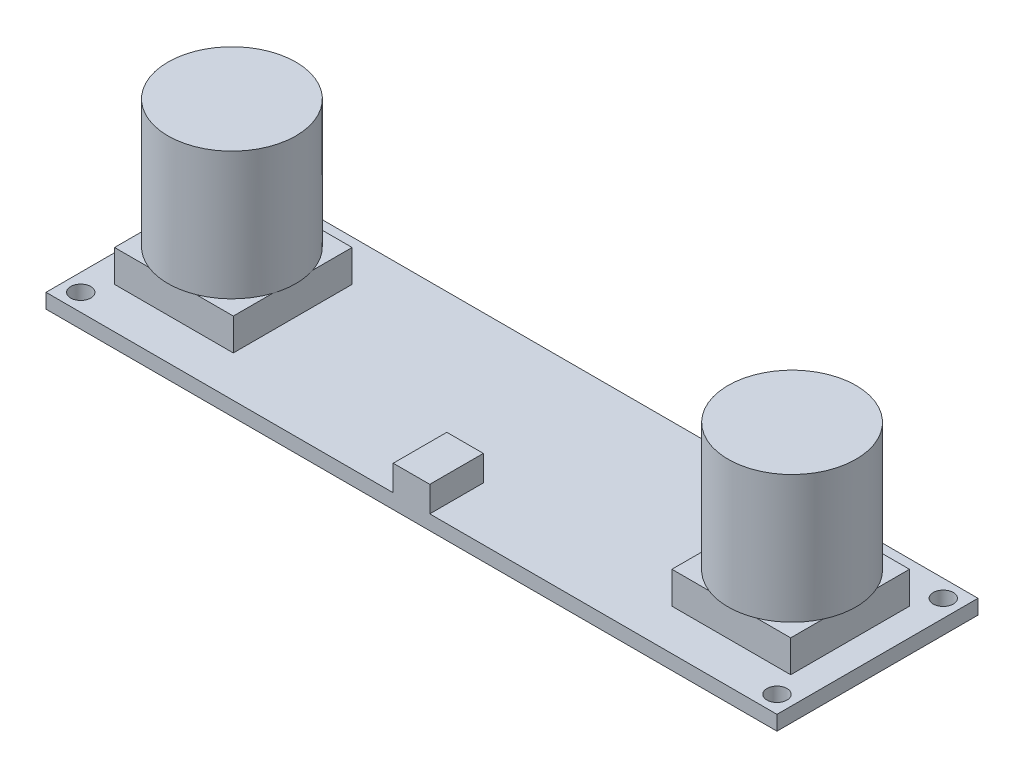
ISO-10303-21;
HEADER;
FILE_DESCRIPTION(('STEP AP214'),'2;1');
FILE_NAME('part.step','',(''),(''),'','','');
FILE_SCHEMA(('AUTOMOTIVE_DESIGN { 1 0 10303 214 1 1 1 1 }'));
ENDSEC;
DATA;
#1=APPLICATION_CONTEXT('core data for automotive mechanical design processes');
#2=APPLICATION_PROTOCOL_DEFINITION('international standard','automotive_design',2000,#1);
#3=PRODUCT_CONTEXT('',#1,'mechanical');
#4=PRODUCT('Part','Part','',(#3));
#5=PRODUCT_RELATED_PRODUCT_CATEGORY('part','',(#4));
#6=PRODUCT_DEFINITION_FORMATION('','',#4);
#7=PRODUCT_DEFINITION_CONTEXT('part definition',#1,'design');
#8=PRODUCT_DEFINITION('design','',#6,#7);
#9=PRODUCT_DEFINITION_SHAPE('','',#8);
#10=(LENGTH_UNIT() NAMED_UNIT(*) SI_UNIT(.MILLI.,.METRE.));
#11=(NAMED_UNIT(*) PLANE_ANGLE_UNIT() SI_UNIT($,.RADIAN.));
#12=(NAMED_UNIT(*) SI_UNIT($,.STERADIAN.) SOLID_ANGLE_UNIT());
#13=UNCERTAINTY_MEASURE_WITH_UNIT(LENGTH_MEASURE(1.E-05),#10,'distance_accuracy_value','');
#14=(GEOMETRIC_REPRESENTATION_CONTEXT(3) GLOBAL_UNCERTAINTY_ASSIGNED_CONTEXT((#13)) GLOBAL_UNIT_ASSIGNED_CONTEXT((#10,
#11,#12)) REPRESENTATION_CONTEXT('',''));
#15=CARTESIAN_POINT('',(0.,0.,0.));
#16=DIRECTION('',(0.,0.,1.));
#17=DIRECTION('',(1.,0.,0.));
#18=AXIS2_PLACEMENT_3D('',#15,#16,#17);
#19=CARTESIAN_POINT('',(0.,1.6,0.));
#20=DIRECTION('',(0.,1.,0.));
#21=DIRECTION('',(0.,0.,1.));
#22=AXIS2_PLACEMENT_3D('',#19,#20,#21);
#23=PLANE('',#22);
#24=CARTESIAN_POINT('',(38.1,1.6,-9.10000000000001));
#25=DIRECTION('',(0.,1.,0.));
#26=DIRECTION('',(0.,0.,-1.));
#27=AXIS2_PLACEMENT_3D('',#24,#25,#26);
#28=CIRCLE('',#27,1.1);
#29=CARTESIAN_POINT('',(38.1,1.6,-10.2));
#30=VERTEX_POINT('',#29);
#31=EDGE_CURVE('E238',#30,#30,#28,.T.);
#32=ORIENTED_EDGE('',*,*,#31,.F.);
#33=EDGE_LOOP('',(#32));
#34=FACE_BOUND('',#33,.T.);
#35=CARTESIAN_POINT('',(38.1,1.6,9.10000000000002));
#36=DIRECTION('',(0.,1.,0.));
#37=DIRECTION('',(0.,0.,1.));
#38=AXIS2_PLACEMENT_3D('',#35,#36,#37);
#39=CIRCLE('',#38,1.1);
#40=CARTESIAN_POINT('',(38.1,1.6,10.2));
#41=VERTEX_POINT('',#40);
#42=EDGE_CURVE('E253',#41,#41,#39,.T.);
#43=ORIENTED_EDGE('',*,*,#42,.F.);
#44=EDGE_LOOP('',(#43));
#45=FACE_BOUND('',#44,.T.);
#46=CARTESIAN_POINT('',(-38.1,1.6,9.10000000000002));
#47=DIRECTION('',(0.,1.,0.));
#48=DIRECTION('',(0.,0.,-1.));
#49=AXIS2_PLACEMENT_3D('',#46,#47,#48);
#50=CIRCLE('',#49,1.1);
#51=CARTESIAN_POINT('',(-38.1,1.6,8.00000000000002));
#52=VERTEX_POINT('',#51);
#53=EDGE_CURVE('E244',#52,#52,#50,.T.);
#54=ORIENTED_EDGE('',*,*,#53,.F.);
#55=EDGE_LOOP('',(#54));
#56=FACE_BOUND('',#55,.T.);
#57=CARTESIAN_POINT('',(-38.1,1.6,-9.10000000000001));
#58=DIRECTION('',(0.,1.,0.));
#59=DIRECTION('',(0.,0.,1.));
#60=AXIS2_PLACEMENT_3D('',#57,#58,#59);
#61=CIRCLE('',#60,1.1);
#62=CARTESIAN_POINT('',(-38.1,1.6,-8.00000000000001));
#63=VERTEX_POINT('',#62);
#64=EDGE_CURVE('E248',#63,#63,#61,.T.);
#65=ORIENTED_EDGE('',*,*,#64,.F.);
#66=EDGE_LOOP('',(#65));
#67=FACE_BOUND('',#66,.T.);
#68=DIRECTION('',(1.,0.,0.));
#69=VECTOR('',#68,1.);
#70=CARTESIAN_POINT('',(-24.,1.6,6.5));
#71=LINE('',#70,#69);
#72=CARTESIAN_POINT('',(-37.,1.6,6.5));
#73=VERTEX_POINT('',#72);
#74=CARTESIAN_POINT('',(-24.,1.6,6.5));
#75=VERTEX_POINT('',#74);
#76=EDGE_CURVE('E370',#73,#75,#71,.T.);
#77=ORIENTED_EDGE('',*,*,#76,.F.);
#78=DIRECTION('',(0.,0.,1.));
#79=VECTOR('',#78,1.);
#80=CARTESIAN_POINT('',(-37.,1.6,6.5));
#81=LINE('',#80,#79);
#82=CARTESIAN_POINT('',(-37.,1.6,-6.5));
#83=VERTEX_POINT('',#82);
#84=EDGE_CURVE('E321',#83,#73,#81,.T.);
#85=ORIENTED_EDGE('',*,*,#84,.F.);
#86=DIRECTION('',(-1.,0.,0.));
#87=VECTOR('',#86,1.);
#88=CARTESIAN_POINT('',(-24.,1.6,-6.5));
#89=LINE('',#88,#87);
#90=CARTESIAN_POINT('',(-24.,1.6,-6.5));
#91=VERTEX_POINT('',#90);
#92=EDGE_CURVE('E377',#91,#83,#89,.T.);
#93=ORIENTED_EDGE('',*,*,#92,.F.);
#94=DIRECTION('',(0.,0.,-1.));
#95=VECTOR('',#94,1.);
#96=CARTESIAN_POINT('',(-24.,1.6,6.5));
#97=LINE('',#96,#95);
#98=EDGE_CURVE('E373',#75,#91,#97,.T.);
#99=ORIENTED_EDGE('',*,*,#98,.F.);
#100=EDGE_LOOP('',(#77,#85,#93,#99));
#101=FACE_BOUND('',#100,.T.);
#102=DIRECTION('',(0.,0.,-1.));
#103=VECTOR('',#102,1.);
#104=CARTESIAN_POINT('',(37.,1.6,6.49999999999999));
#105=LINE('',#104,#103);
#106=CARTESIAN_POINT('',(37.,1.6,6.49999999999999));
#107=VERTEX_POINT('',#106);
#108=CARTESIAN_POINT('',(37.,1.6,-6.50000000000001));
#109=VERTEX_POINT('',#108);
#110=EDGE_CURVE('E314',#107,#109,#105,.T.);
#111=ORIENTED_EDGE('',*,*,#110,.F.);
#112=DIRECTION('',(1.,0.,0.));
#113=VECTOR('',#112,1.);
#114=CARTESIAN_POINT('',(24.,1.6,6.49999999999999));
#115=LINE('',#114,#113);
#116=CARTESIAN_POINT('',(24.,1.6,6.49999999999999));
#117=VERTEX_POINT('',#116);
#118=EDGE_CURVE('E317',#117,#107,#115,.T.);
#119=ORIENTED_EDGE('',*,*,#118,.F.);
#120=DIRECTION('',(0.,0.,1.));
#121=VECTOR('',#120,1.);
#122=CARTESIAN_POINT('',(24.,1.6,6.49999999999999));
#123=LINE('',#122,#121);
#124=CARTESIAN_POINT('',(24.,1.6,-6.50000000000001));
#125=VERTEX_POINT('',#124);
#126=EDGE_CURVE('E306',#125,#117,#123,.T.);
#127=ORIENTED_EDGE('',*,*,#126,.F.);
#128=DIRECTION('',(-1.,0.,0.));
#129=VECTOR('',#128,1.);
#130=CARTESIAN_POINT('',(24.,1.6,-6.50000000000001));
#131=LINE('',#130,#129);
#132=EDGE_CURVE('E309',#109,#125,#131,.T.);
#133=ORIENTED_EDGE('',*,*,#132,.F.);
#134=EDGE_LOOP('',(#111,#119,#127,#133));
#135=FACE_BOUND('',#134,.T.);
#136=DIRECTION('',(-1.,0.,0.));
#137=VECTOR('',#136,1.);
#138=CARTESIAN_POINT('',(-1.99999999999999,1.6,5.13629272388911));
#139=LINE('',#138,#137);
#140=CARTESIAN_POINT('',(2.00000000000002,1.6,5.13629272388911));
#141=VERTEX_POINT('',#140);
#142=CARTESIAN_POINT('',(-1.99999999999999,1.6,5.13629272388911));
#143=VERTEX_POINT('',#142);
#144=EDGE_CURVE('E62',#141,#143,#139,.T.);
#145=ORIENTED_EDGE('',*,*,#144,.F.);
#146=DIRECTION('',(0.,0.,-1.));
#147=VECTOR('',#146,1.);
#148=CARTESIAN_POINT('',(2.00000000000002,1.6,5.13629272388911));
#149=LINE('',#148,#147);
#150=CARTESIAN_POINT('',(2.00000000000002,1.6,11.));
#151=VERTEX_POINT('',#150);
#152=EDGE_CURVE('E963',#151,#141,#149,.T.);
#153=ORIENTED_EDGE('',*,*,#152,.F.);
#154=DIRECTION('',(1.,0.,0.));
#155=VECTOR('',#154,1.);
#156=CARTESIAN_POINT('',(40.,1.6,11.));
#157=LINE('',#156,#155);
#158=CARTESIAN_POINT('',(40.,1.6,11.));
#159=VERTEX_POINT('',#158);
#160=EDGE_CURVE('E231',#151,#159,#157,.T.);
#161=ORIENTED_EDGE('',*,*,#160,.T.);
#162=DIRECTION('',(0.,0.,-1.));
#163=VECTOR('',#162,1.);
#164=CARTESIAN_POINT('',(40.,1.6,11.));
#165=LINE('',#164,#163);
#166=CARTESIAN_POINT('',(40.,1.6,-11.));
#167=VERTEX_POINT('',#166);
#168=EDGE_CURVE('E402',#159,#167,#165,.T.);
#169=ORIENTED_EDGE('',*,*,#168,.T.);
#170=DIRECTION('',(-1.,0.,0.));
#171=VECTOR('',#170,1.);
#172=CARTESIAN_POINT('',(40.,1.6,-11.));
#173=LINE('',#172,#171);
#174=CARTESIAN_POINT('',(-40.,1.6,-11.));
#175=VERTEX_POINT('',#174);
#176=EDGE_CURVE('E405',#167,#175,#173,.T.);
#177=ORIENTED_EDGE('',*,*,#176,.T.);
#178=DIRECTION('',(0.,0.,1.));
#179=VECTOR('',#178,1.);
#180=CARTESIAN_POINT('',(-40.,1.6,11.));
#181=LINE('',#180,#179);
#182=CARTESIAN_POINT('',(-40.,1.6,11.));
#183=VERTEX_POINT('',#182);
#184=EDGE_CURVE('E394',#175,#183,#181,.T.);
#185=ORIENTED_EDGE('',*,*,#184,.T.);
#186=CARTESIAN_POINT('',(-1.99999999999999,1.6,11.));
#187=VERTEX_POINT('',#186);
#188=EDGE_CURVE('E399',#183,#187,#157,.T.);
#189=ORIENTED_EDGE('',*,*,#188,.T.);
#190=DIRECTION('',(0.,0.,1.));
#191=VECTOR('',#190,1.);
#192=CARTESIAN_POINT('',(-1.99999999999999,1.6,11.));
#193=LINE('',#192,#191);
#194=EDGE_CURVE('E67',#143,#187,#193,.T.);
#195=ORIENTED_EDGE('',*,*,#194,.F.);
#196=EDGE_LOOP('',(#145,#153,#161,#169,#177,#185,#189,#195));
#197=FACE_BOUND('',#196,.T.);
#198=ADVANCED_FACE('F43',(#34,#45,#56,#67,#101,#135,#197),#23,.T.);
#199=CARTESIAN_POINT('',(0.,5.1,0.));
#200=DIRECTION('',(0.,1.,0.));
#201=DIRECTION('',(0.,0.,1.));
#202=AXIS2_PLACEMENT_3D('',#199,#200,#201);
#203=PLANE('',#202);
#204=CARTESIAN_POINT('',(30.65,5.1,0.));
#205=DIRECTION('',(0.,1.,0.));
#206=DIRECTION('',(0.,0.,-1.));
#207=AXIS2_PLACEMENT_3D('',#204,#205,#206);
#208=CIRCLE('',#207,7.);
#209=CARTESIAN_POINT('',(28.0519237886467,5.1,-6.50000000000001));
#210=VERTEX_POINT('',#209);
#211=CARTESIAN_POINT('',(24.,5.1,-2.18574929943935));
#212=VERTEX_POINT('',#211);
#213=EDGE_CURVE('E271',#210,#212,#208,.T.);
#214=ORIENTED_EDGE('',*,*,#213,.F.);
#215=DIRECTION('',(-1.,0.,0.));
#216=VECTOR('',#215,1.);
#217=CARTESIAN_POINT('',(24.,5.1,-6.50000000000001));
#218=LINE('',#217,#216);
#219=CARTESIAN_POINT('',(24.,5.1,-6.50000000000001));
#220=VERTEX_POINT('',#219);
#221=EDGE_CURVE('E326',#210,#220,#218,.T.);
#222=ORIENTED_EDGE('',*,*,#221,.T.);
#223=DIRECTION('',(0.,0.,1.));
#224=VECTOR('',#223,1.);
#225=CARTESIAN_POINT('',(24.,5.1,6.49999999999999));
#226=LINE('',#225,#224);
#227=EDGE_CURVE('E322',#220,#212,#226,.T.);
#228=ORIENTED_EDGE('',*,*,#227,.T.);
#229=EDGE_LOOP('',(#214,#222,#228));
#230=FACE_BOUND('',#229,.T.);
#231=ADVANCED_FACE('F514',(#230),#203,.T.);
#232=CARTESIAN_POINT('',(24.,5.1,2.18574929943935));
#233=VERTEX_POINT('',#232);
#234=CARTESIAN_POINT('',(28.0519237886467,5.1,6.49999999999999));
#235=VERTEX_POINT('',#234);
#236=EDGE_CURVE('E11',#233,#235,#208,.T.);
#237=ORIENTED_EDGE('',*,*,#236,.F.);
#238=CARTESIAN_POINT('',(24.,5.1,6.49999999999999));
#239=VERTEX_POINT('',#238);
#240=EDGE_CURVE('E305',#233,#239,#226,.T.);
#241=ORIENTED_EDGE('',*,*,#240,.T.);
#242=DIRECTION('',(1.,0.,0.));
#243=VECTOR('',#242,1.);
#244=CARTESIAN_POINT('',(24.,5.1,6.49999999999999));
#245=LINE('',#244,#243);
#246=EDGE_CURVE('E310',#239,#235,#245,.T.);
#247=ORIENTED_EDGE('',*,*,#246,.T.);
#248=EDGE_LOOP('',(#237,#241,#247));
#249=FACE_BOUND('',#248,.T.);
#250=ADVANCED_FACE('F571',(#249),#203,.T.);
#251=CARTESIAN_POINT('',(33.2480762113534,5.1,6.49999999999999));
#252=VERTEX_POINT('',#251);
#253=CARTESIAN_POINT('',(37.,5.1,2.94575966433116));
#254=VERTEX_POINT('',#253);
#255=EDGE_CURVE('E53',#252,#254,#208,.T.);
#256=ORIENTED_EDGE('',*,*,#255,.F.);
#257=CARTESIAN_POINT('',(37.,5.1,6.49999999999999));
#258=VERTEX_POINT('',#257);
#259=EDGE_CURVE('E337',#252,#258,#245,.T.);
#260=ORIENTED_EDGE('',*,*,#259,.T.);
#261=DIRECTION('',(0.,0.,-1.));
#262=VECTOR('',#261,1.);
#263=CARTESIAN_POINT('',(37.,5.1,6.49999999999999));
#264=LINE('',#263,#262);
#265=EDGE_CURVE('E333',#258,#254,#264,.T.);
#266=ORIENTED_EDGE('',*,*,#265,.T.);
#267=EDGE_LOOP('',(#256,#260,#266));
#268=FACE_BOUND('',#267,.T.);
#269=ADVANCED_FACE('F582',(#268),#203,.T.);
#270=CARTESIAN_POINT('',(0.,5.1,0.));
#271=DIRECTION('',(0.,1.,0.));
#272=DIRECTION('',(0.,0.,1.));
#273=AXIS2_PLACEMENT_3D('',#270,#271,#272);
#274=PLANE('',#273);
#275=CARTESIAN_POINT('',(-30.65,5.1,0.));
#276=DIRECTION('',(0.,1.,0.));
#277=DIRECTION('',(0.,0.,1.));
#278=AXIS2_PLACEMENT_3D('',#275,#276,#277);
#279=CIRCLE('',#278,7.);
#280=CARTESIAN_POINT('',(-28.0519237886467,5.1,6.5));
#281=VERTEX_POINT('',#280);
#282=CARTESIAN_POINT('',(-24.,5.1,2.18574929943942));
#283=VERTEX_POINT('',#282);
#284=EDGE_CURVE('E286',#281,#283,#279,.T.);
#285=ORIENTED_EDGE('',*,*,#284,.F.);
#286=DIRECTION('',(1.,0.,0.));
#287=VECTOR('',#286,1.);
#288=CARTESIAN_POINT('',(-24.,5.1,6.5));
#289=LINE('',#288,#287);
#290=CARTESIAN_POINT('',(-24.,5.1,6.5));
#291=VERTEX_POINT('',#290);
#292=EDGE_CURVE('E347',#281,#291,#289,.T.);
#293=ORIENTED_EDGE('',*,*,#292,.T.);
#294=DIRECTION('',(0.,0.,-1.));
#295=VECTOR('',#294,1.);
#296=CARTESIAN_POINT('',(-24.,5.1,6.5));
#297=LINE('',#296,#295);
#298=EDGE_CURVE('E355',#291,#283,#297,.T.);
#299=ORIENTED_EDGE('',*,*,#298,.T.);
#300=EDGE_LOOP('',(#285,#293,#299));
#301=FACE_BOUND('',#300,.T.);
#302=ADVANCED_FACE('F472',(#301),#274,.T.);
#303=CARTESIAN_POINT('',(-24.,5.1,-2.18574929943943));
#304=VERTEX_POINT('',#303);
#305=CARTESIAN_POINT('',(-28.0519237886467,5.1,-6.5));
#306=VERTEX_POINT('',#305);
#307=EDGE_CURVE('E443',#304,#306,#279,.T.);
#308=ORIENTED_EDGE('',*,*,#307,.F.);
#309=CARTESIAN_POINT('',(-24.,5.1,-6.5));
#310=VERTEX_POINT('',#309);
#311=EDGE_CURVE('E353',#304,#310,#297,.T.);
#312=ORIENTED_EDGE('',*,*,#311,.T.);
#313=DIRECTION('',(-1.,0.,0.));
#314=VECTOR('',#313,1.);
#315=CARTESIAN_POINT('',(-24.,5.1,-6.5));
#316=LINE('',#315,#314);
#317=EDGE_CURVE('E361',#310,#306,#316,.T.);
#318=ORIENTED_EDGE('',*,*,#317,.T.);
#319=EDGE_LOOP('',(#308,#312,#318));
#320=FACE_BOUND('',#319,.T.);
#321=ADVANCED_FACE('F486',(#320),#274,.T.);
#322=CARTESIAN_POINT('',(-33.2480762113533,5.1,-6.5));
#323=VERTEX_POINT('',#322);
#324=CARTESIAN_POINT('',(-37.,5.1,-2.9457596643311));
#325=VERTEX_POINT('',#324);
#326=EDGE_CURVE('E437',#323,#325,#279,.T.);
#327=ORIENTED_EDGE('',*,*,#326,.F.);
#328=CARTESIAN_POINT('',(-37.,5.1,-6.5));
#329=VERTEX_POINT('',#328);
#330=EDGE_CURVE('E359',#323,#329,#316,.T.);
#331=ORIENTED_EDGE('',*,*,#330,.T.);
#332=DIRECTION('',(0.,0.,1.));
#333=VECTOR('',#332,1.);
#334=CARTESIAN_POINT('',(-37.,5.1,6.5));
#335=LINE('',#334,#333);
#336=EDGE_CURVE('E343',#329,#325,#335,.T.);
#337=ORIENTED_EDGE('',*,*,#336,.T.);
#338=EDGE_LOOP('',(#327,#331,#337));
#339=FACE_BOUND('',#338,.T.);
#340=ADVANCED_FACE('F498',(#339),#274,.T.);
#341=CARTESIAN_POINT('',(-40.,1.6,11.));
#342=DIRECTION('',(1.,0.,0.));
#343=DIRECTION('',(0.,0.,-1.));
#344=AXIS2_PLACEMENT_3D('',#341,#342,#343);
#345=PLANE('',#344);
#346=DIRECTION('',(0.,0.,1.));
#347=VECTOR('',#346,1.);
#348=CARTESIAN_POINT('',(-40.,0.,11.));
#349=LINE('',#348,#347);
#350=CARTESIAN_POINT('',(-40.,0.,-11.));
#351=VERTEX_POINT('',#350);
#352=CARTESIAN_POINT('',(-40.,0.,11.));
#353=VERTEX_POINT('',#352);
#354=EDGE_CURVE('E393',#351,#353,#349,.T.);
#355=ORIENTED_EDGE('',*,*,#354,.T.);
#356=DIRECTION('',(0.,-1.,0.));
#357=VECTOR('',#356,1.);
#358=CARTESIAN_POINT('',(-40.,1.6,11.));
#359=LINE('',#358,#357);
#360=EDGE_CURVE('E47',#183,#353,#359,.T.);
#361=ORIENTED_EDGE('',*,*,#360,.F.);
#362=ORIENTED_EDGE('',*,*,#184,.F.);
#363=DIRECTION('',(0.,-1.,0.));
#364=VECTOR('',#363,1.);
#365=CARTESIAN_POINT('',(-40.,1.6,-11.));
#366=LINE('',#365,#364);
#367=EDGE_CURVE('E408',#175,#351,#366,.T.);
#368=ORIENTED_EDGE('',*,*,#367,.T.);
#369=EDGE_LOOP('',(#355,#361,#362,#368));
#370=FACE_BOUND('',#369,.T.);
#371=ADVANCED_FACE('F45',(#370),#345,.F.);
#372=CARTESIAN_POINT('',(40.,1.6,11.));
#373=DIRECTION('',(0.,0.,-1.));
#374=DIRECTION('',(-1.,0.,0.));
#375=AXIS2_PLACEMENT_3D('',#372,#373,#374);
#376=PLANE('',#375);
#377=DIRECTION('',(1.,0.,0.));
#378=VECTOR('',#377,1.);
#379=CARTESIAN_POINT('',(40.,0.,11.));
#380=LINE('',#379,#378);
#381=CARTESIAN_POINT('',(40.,0.,11.));
#382=VERTEX_POINT('',#381);
#383=EDGE_CURVE('E412',#353,#382,#380,.T.);
#384=ORIENTED_EDGE('',*,*,#383,.T.);
#385=DIRECTION('',(0.,-1.,0.));
#386=VECTOR('',#385,1.);
#387=CARTESIAN_POINT('',(40.,1.6,11.));
#388=LINE('',#387,#386);
#389=EDGE_CURVE('E426',#159,#382,#388,.T.);
#390=ORIENTED_EDGE('',*,*,#389,.F.);
#391=ORIENTED_EDGE('',*,*,#160,.F.);
#392=DIRECTION('',(0.,-1.,0.));
#393=VECTOR('',#392,1.);
#394=CARTESIAN_POINT('',(2.00000000000002,4.4,11.));
#395=LINE('',#394,#393);
#396=CARTESIAN_POINT('',(2.00000000000002,4.4,11.));
#397=VERTEX_POINT('',#396);
#398=EDGE_CURVE('E211',#397,#151,#395,.T.);
#399=ORIENTED_EDGE('',*,*,#398,.F.);
#400=DIRECTION('',(1.,0.,0.));
#401=VECTOR('',#400,1.);
#402=CARTESIAN_POINT('',(0.,4.4,11.));
#403=LINE('',#402,#401);
#404=CARTESIAN_POINT('',(-1.99999999999999,4.4,11.));
#405=VERTEX_POINT('',#404);
#406=EDGE_CURVE('E218',#405,#397,#403,.T.);
#407=ORIENTED_EDGE('',*,*,#406,.F.);
#408=DIRECTION('',(0.,-1.,0.));
#409=VECTOR('',#408,1.);
#410=CARTESIAN_POINT('',(-1.99999999999999,4.4,11.));
#411=LINE('',#410,#409);
#412=EDGE_CURVE('E951',#405,#187,#411,.T.);
#413=ORIENTED_EDGE('',*,*,#412,.T.);
#414=ORIENTED_EDGE('',*,*,#188,.F.);
#415=ORIENTED_EDGE('',*,*,#360,.T.);
#416=EDGE_LOOP('',(#384,#390,#391,#399,#407,#413,#414,#415));
#417=FACE_BOUND('',#416,.T.);
#418=ADVANCED_FACE('F229',(#417),#376,.F.);
#419=CARTESIAN_POINT('',(40.,1.6,11.));
#420=DIRECTION('',(-1.,0.,0.));
#421=DIRECTION('',(0.,0.,1.));
#422=AXIS2_PLACEMENT_3D('',#419,#420,#421);
#423=PLANE('',#422);
#424=DIRECTION('',(0.,0.,-1.));
#425=VECTOR('',#424,1.);
#426=CARTESIAN_POINT('',(40.,0.,11.));
#427=LINE('',#426,#425);
#428=CARTESIAN_POINT('',(40.,0.,-11.));
#429=VERTEX_POINT('',#428);
#430=EDGE_CURVE('E415',#382,#429,#427,.T.);
#431=ORIENTED_EDGE('',*,*,#430,.T.);
#432=DIRECTION('',(0.,-1.,0.));
#433=VECTOR('',#432,1.);
#434=CARTESIAN_POINT('',(40.,1.6,-11.));
#435=LINE('',#434,#433);
#436=EDGE_CURVE('E423',#167,#429,#435,.T.);
#437=ORIENTED_EDGE('',*,*,#436,.F.);
#438=ORIENTED_EDGE('',*,*,#168,.F.);
#439=ORIENTED_EDGE('',*,*,#389,.T.);
#440=EDGE_LOOP('',(#431,#437,#438,#439));
#441=FACE_BOUND('',#440,.T.);
#442=ADVANCED_FACE('F903',(#441),#423,.F.);
#443=CARTESIAN_POINT('',(40.,1.6,-11.));
#444=DIRECTION('',(0.,0.,1.));
#445=DIRECTION('',(1.,0.,0.));
#446=AXIS2_PLACEMENT_3D('',#443,#444,#445);
#447=PLANE('',#446);
#448=DIRECTION('',(-1.,0.,0.));
#449=VECTOR('',#448,1.);
#450=CARTESIAN_POINT('',(40.,0.,-11.));
#451=LINE('',#450,#449);
#452=EDGE_CURVE('E398',#429,#351,#451,.T.);
#453=ORIENTED_EDGE('',*,*,#452,.T.);
#454=ORIENTED_EDGE('',*,*,#367,.F.);
#455=ORIENTED_EDGE('',*,*,#176,.F.);
#456=ORIENTED_EDGE('',*,*,#436,.T.);
#457=EDGE_LOOP('',(#453,#454,#455,#456));
#458=FACE_BOUND('',#457,.T.);
#459=ADVANCED_FACE('F843',(#458),#447,.F.);
#460=CARTESIAN_POINT('',(0.,0.,0.));
#461=DIRECTION('',(0.,1.,0.));
#462=DIRECTION('',(0.,0.,1.));
#463=AXIS2_PLACEMENT_3D('',#460,#461,#462);
#464=PLANE('',#463);
#465=CARTESIAN_POINT('',(38.1,0.,-9.10000000000001));
#466=DIRECTION('',(0.,1.,0.));
#467=DIRECTION('',(0.,0.,-1.));
#468=AXIS2_PLACEMENT_3D('',#465,#466,#467);
#469=CIRCLE('',#468,1.1);
#470=CARTESIAN_POINT('',(38.1,0.,-10.2));
#471=VERTEX_POINT('',#470);
#472=EDGE_CURVE('E233',#471,#471,#469,.T.);
#473=ORIENTED_EDGE('',*,*,#472,.T.);
#474=EDGE_LOOP('',(#473));
#475=FACE_BOUND('',#474,.T.);
#476=CARTESIAN_POINT('',(38.1,0.,9.10000000000002));
#477=DIRECTION('',(0.,1.,0.));
#478=DIRECTION('',(0.,0.,1.));
#479=AXIS2_PLACEMENT_3D('',#476,#477,#478);
#480=CIRCLE('',#479,1.1);
#481=CARTESIAN_POINT('',(38.1,0.,10.2));
#482=VERTEX_POINT('',#481);
#483=EDGE_CURVE('E257',#482,#482,#480,.T.);
#484=ORIENTED_EDGE('',*,*,#483,.T.);
#485=EDGE_LOOP('',(#484));
#486=FACE_BOUND('',#485,.T.);
#487=CARTESIAN_POINT('',(-38.1,0.,9.10000000000002));
#488=DIRECTION('',(0.,1.,0.));
#489=DIRECTION('',(0.,0.,-1.));
#490=AXIS2_PLACEMENT_3D('',#487,#488,#489);
#491=CIRCLE('',#490,1.1);
#492=CARTESIAN_POINT('',(-38.1,0.,8.00000000000002));
#493=VERTEX_POINT('',#492);
#494=EDGE_CURVE('E249',#493,#493,#491,.T.);
#495=ORIENTED_EDGE('',*,*,#494,.T.);
#496=EDGE_LOOP('',(#495));
#497=FACE_BOUND('',#496,.T.);
#498=CARTESIAN_POINT('',(-38.1,0.,-9.10000000000001));
#499=DIRECTION('',(0.,1.,0.));
#500=DIRECTION('',(0.,0.,1.));
#501=AXIS2_PLACEMENT_3D('',#498,#499,#500);
#502=CIRCLE('',#501,1.1);
#503=CARTESIAN_POINT('',(-38.1,0.,-8.00000000000001));
#504=VERTEX_POINT('',#503);
#505=EDGE_CURVE('E264',#504,#504,#502,.T.);
#506=ORIENTED_EDGE('',*,*,#505,.T.);
#507=EDGE_LOOP('',(#506));
#508=FACE_BOUND('',#507,.T.);
#509=ORIENTED_EDGE('',*,*,#354,.F.);
#510=ORIENTED_EDGE('',*,*,#452,.F.);
#511=ORIENTED_EDGE('',*,*,#430,.F.);
#512=ORIENTED_EDGE('',*,*,#383,.F.);
#513=EDGE_LOOP('',(#509,#510,#511,#512));
#514=FACE_BOUND('',#513,.T.);
#515=ADVANCED_FACE('F648',(#475,#486,#497,#508,#514),#464,.F.);
#516=CARTESIAN_POINT('',(-37.,5.1,6.5));
#517=DIRECTION('',(1.,0.,0.));
#518=DIRECTION('',(0.,0.,-1.));
#519=AXIS2_PLACEMENT_3D('',#516,#517,#518);
#520=PLANE('',#519);
#521=ORIENTED_EDGE('',*,*,#84,.T.);
#522=DIRECTION('',(0.,-1.,0.));
#523=VECTOR('',#522,1.);
#524=CARTESIAN_POINT('',(-37.,5.1,6.5));
#525=LINE('',#524,#523);
#526=CARTESIAN_POINT('',(-37.,5.1,6.5));
#527=VERTEX_POINT('',#526);
#528=EDGE_CURVE('E390',#527,#73,#525,.T.);
#529=ORIENTED_EDGE('',*,*,#528,.F.);
#530=CARTESIAN_POINT('',(-37.,5.1,2.9457596643311));
#531=VERTEX_POINT('',#530);
#532=EDGE_CURVE('E349',#531,#527,#335,.T.);
#533=ORIENTED_EDGE('',*,*,#532,.F.);
#534=EDGE_CURVE('E348',#325,#531,#335,.T.);
#535=ORIENTED_EDGE('',*,*,#534,.F.);
#536=ORIENTED_EDGE('',*,*,#336,.F.);
#537=DIRECTION('',(0.,-1.,0.));
#538=VECTOR('',#537,1.);
#539=CARTESIAN_POINT('',(-37.,5.1,-6.5));
#540=LINE('',#539,#538);
#541=EDGE_CURVE('E365',#329,#83,#540,.T.);
#542=ORIENTED_EDGE('',*,*,#541,.T.);
#543=EDGE_LOOP('',(#521,#529,#533,#535,#536,#542));
#544=FACE_BOUND('',#543,.T.);
#545=ADVANCED_FACE('F502',(#544),#520,.F.);
#546=CARTESIAN_POINT('',(-24.,5.1,6.5));
#547=DIRECTION('',(0.,0.,-1.));
#548=DIRECTION('',(-1.,0.,0.));
#549=AXIS2_PLACEMENT_3D('',#546,#547,#548);
#550=PLANE('',#549);
#551=ORIENTED_EDGE('',*,*,#76,.T.);
#552=DIRECTION('',(0.,-1.,0.));
#553=VECTOR('',#552,1.);
#554=CARTESIAN_POINT('',(-24.,5.1,6.5));
#555=LINE('',#554,#553);
#556=EDGE_CURVE('E386',#291,#75,#555,.T.);
#557=ORIENTED_EDGE('',*,*,#556,.F.);
#558=ORIENTED_EDGE('',*,*,#292,.F.);
#559=CARTESIAN_POINT('',(-33.2480762113533,5.1,6.5));
#560=VERTEX_POINT('',#559);
#561=EDGE_CURVE('E354',#560,#281,#289,.T.);
#562=ORIENTED_EDGE('',*,*,#561,.F.);
#563=EDGE_CURVE('E350',#527,#560,#289,.T.);
#564=ORIENTED_EDGE('',*,*,#563,.F.);
#565=ORIENTED_EDGE('',*,*,#528,.T.);
#566=EDGE_LOOP('',(#551,#557,#558,#562,#564,#565));
#567=FACE_BOUND('',#566,.T.);
#568=ADVANCED_FACE('F474',(#567),#550,.F.);
#569=CARTESIAN_POINT('',(-24.,5.1,6.5));
#570=DIRECTION('',(-1.,0.,0.));
#571=DIRECTION('',(0.,0.,1.));
#572=AXIS2_PLACEMENT_3D('',#569,#570,#571);
#573=PLANE('',#572);
#574=ORIENTED_EDGE('',*,*,#98,.T.);
#575=DIRECTION('',(0.,-1.,0.));
#576=VECTOR('',#575,1.);
#577=CARTESIAN_POINT('',(-24.,5.1,-6.5));
#578=LINE('',#577,#576);
#579=EDGE_CURVE('E383',#310,#91,#578,.T.);
#580=ORIENTED_EDGE('',*,*,#579,.F.);
#581=ORIENTED_EDGE('',*,*,#311,.F.);
#582=EDGE_CURVE('E360',#283,#304,#297,.T.);
#583=ORIENTED_EDGE('',*,*,#582,.F.);
#584=ORIENTED_EDGE('',*,*,#298,.F.);
#585=ORIENTED_EDGE('',*,*,#556,.T.);
#586=EDGE_LOOP('',(#574,#580,#581,#583,#584,#585));
#587=FACE_BOUND('',#586,.T.);
#588=ADVANCED_FACE('F478',(#587),#573,.F.);
#589=CARTESIAN_POINT('',(-24.,5.1,-6.5));
#590=DIRECTION('',(0.,0.,1.));
#591=DIRECTION('',(1.,0.,0.));
#592=AXIS2_PLACEMENT_3D('',#589,#590,#591);
#593=PLANE('',#592);
#594=ORIENTED_EDGE('',*,*,#92,.T.);
#595=ORIENTED_EDGE('',*,*,#541,.F.);
#596=ORIENTED_EDGE('',*,*,#330,.F.);
#597=EDGE_CURVE('E366',#306,#323,#316,.T.);
#598=ORIENTED_EDGE('',*,*,#597,.F.);
#599=ORIENTED_EDGE('',*,*,#317,.F.);
#600=ORIENTED_EDGE('',*,*,#579,.T.);
#601=EDGE_LOOP('',(#594,#595,#596,#598,#599,#600));
#602=FACE_BOUND('',#601,.T.);
#603=ADVANCED_FACE('F490',(#602),#593,.F.);
#604=EDGE_CURVE('E291',#531,#560,#279,.T.);
#605=ORIENTED_EDGE('',*,*,#604,.F.);
#606=ORIENTED_EDGE('',*,*,#532,.T.);
#607=ORIENTED_EDGE('',*,*,#563,.T.);
#608=EDGE_LOOP('',(#605,#606,#607));
#609=FACE_BOUND('',#608,.T.);
#610=ADVANCED_FACE('F510',(#609),#274,.T.);
#611=CARTESIAN_POINT('',(24.,5.1,6.49999999999999));
#612=DIRECTION('',(0.,0.,-1.));
#613=DIRECTION('',(-1.,0.,0.));
#614=AXIS2_PLACEMENT_3D('',#611,#612,#613);
#615=PLANE('',#614);
#616=ORIENTED_EDGE('',*,*,#118,.T.);
#617=DIRECTION('',(0.,-1.,0.));
#618=VECTOR('',#617,1.);
#619=CARTESIAN_POINT('',(37.,5.1,6.49999999999999));
#620=LINE('',#619,#618);
#621=EDGE_CURVE('E285',#258,#107,#620,.T.);
#622=ORIENTED_EDGE('',*,*,#621,.F.);
#623=ORIENTED_EDGE('',*,*,#259,.F.);
#624=EDGE_CURVE('E342',#235,#252,#245,.T.);
#625=ORIENTED_EDGE('',*,*,#624,.F.);
#626=ORIENTED_EDGE('',*,*,#246,.F.);
#627=DIRECTION('',(0.,-1.,0.));
#628=VECTOR('',#627,1.);
#629=CARTESIAN_POINT('',(24.,5.1,6.49999999999999));
#630=LINE('',#629,#628);
#631=EDGE_CURVE('E301',#239,#117,#630,.T.);
#632=ORIENTED_EDGE('',*,*,#631,.T.);
#633=EDGE_LOOP('',(#616,#622,#623,#625,#626,#632));
#634=FACE_BOUND('',#633,.T.);
#635=ADVANCED_FACE('F575',(#634),#615,.F.);
#636=CARTESIAN_POINT('',(37.,5.1,6.49999999999999));
#637=DIRECTION('',(-1.,0.,0.));
#638=DIRECTION('',(0.,0.,1.));
#639=AXIS2_PLACEMENT_3D('',#636,#637,#638);
#640=PLANE('',#639);
#641=ORIENTED_EDGE('',*,*,#110,.T.);
#642=DIRECTION('',(0.,-1.,0.));
#643=VECTOR('',#642,1.);
#644=CARTESIAN_POINT('',(37.,5.1,-6.50000000000001));
#645=LINE('',#644,#643);
#646=CARTESIAN_POINT('',(37.,5.1,-6.50000000000001));
#647=VERTEX_POINT('',#646);
#648=EDGE_CURVE('E294',#647,#109,#645,.T.);
#649=ORIENTED_EDGE('',*,*,#648,.F.);
#650=CARTESIAN_POINT('',(37.,5.1,-2.94575966433116));
#651=VERTEX_POINT('',#650);
#652=EDGE_CURVE('E331',#651,#647,#264,.T.);
#653=ORIENTED_EDGE('',*,*,#652,.F.);
#654=EDGE_CURVE('E338',#254,#651,#264,.T.);
#655=ORIENTED_EDGE('',*,*,#654,.F.);
#656=ORIENTED_EDGE('',*,*,#265,.F.);
#657=ORIENTED_EDGE('',*,*,#621,.T.);
#658=EDGE_LOOP('',(#641,#649,#653,#655,#656,#657));
#659=FACE_BOUND('',#658,.T.);
#660=ADVANCED_FACE('F523',(#659),#640,.F.);
#661=CARTESIAN_POINT('',(24.,5.1,-6.50000000000001));
#662=DIRECTION('',(0.,0.,1.));
#663=DIRECTION('',(1.,0.,0.));
#664=AXIS2_PLACEMENT_3D('',#661,#662,#663);
#665=PLANE('',#664);
#666=ORIENTED_EDGE('',*,*,#132,.T.);
#667=DIRECTION('',(0.,-1.,0.));
#668=VECTOR('',#667,1.);
#669=CARTESIAN_POINT('',(24.,5.1,-6.50000000000001));
#670=LINE('',#669,#668);
#671=EDGE_CURVE('E298',#220,#125,#670,.T.);
#672=ORIENTED_EDGE('',*,*,#671,.F.);
#673=ORIENTED_EDGE('',*,*,#221,.F.);
#674=CARTESIAN_POINT('',(33.2480762113533,5.1,-6.50000000000001));
#675=VERTEX_POINT('',#674);
#676=EDGE_CURVE('E332',#675,#210,#218,.T.);
#677=ORIENTED_EDGE('',*,*,#676,.F.);
#678=EDGE_CURVE('E328',#647,#675,#218,.T.);
#679=ORIENTED_EDGE('',*,*,#678,.F.);
#680=ORIENTED_EDGE('',*,*,#648,.T.);
#681=EDGE_LOOP('',(#666,#672,#673,#677,#679,#680));
#682=FACE_BOUND('',#681,.T.);
#683=ADVANCED_FACE('F529',(#682),#665,.F.);
#684=CARTESIAN_POINT('',(24.,5.1,6.49999999999999));
#685=DIRECTION('',(1.,0.,0.));
#686=DIRECTION('',(0.,0.,-1.));
#687=AXIS2_PLACEMENT_3D('',#684,#685,#686);
#688=PLANE('',#687);
#689=ORIENTED_EDGE('',*,*,#126,.T.);
#690=ORIENTED_EDGE('',*,*,#631,.F.);
#691=ORIENTED_EDGE('',*,*,#240,.F.);
#692=EDGE_CURVE('E327',#212,#233,#226,.T.);
#693=ORIENTED_EDGE('',*,*,#692,.F.);
#694=ORIENTED_EDGE('',*,*,#227,.F.);
#695=ORIENTED_EDGE('',*,*,#671,.T.);
#696=EDGE_LOOP('',(#689,#690,#691,#693,#694,#695));
#697=FACE_BOUND('',#696,.T.);
#698=ADVANCED_FACE('F563',(#697),#688,.F.);
#699=EDGE_CURVE('E277',#651,#675,#208,.T.);
#700=ORIENTED_EDGE('',*,*,#699,.F.);
#701=ORIENTED_EDGE('',*,*,#652,.T.);
#702=ORIENTED_EDGE('',*,*,#678,.T.);
#703=EDGE_LOOP('',(#700,#701,#702));
#704=FACE_BOUND('',#703,.T.);
#705=ADVANCED_FACE('F536',(#704),#203,.T.);
#706=CARTESIAN_POINT('',(-30.65,5.1,0.));
#707=DIRECTION('',(0.,1.,0.));
#708=DIRECTION('',(0.,0.,1.));
#709=AXIS2_PLACEMENT_3D('',#706,#707,#708);
#710=PLANE('',#709);
#711=EDGE_CURVE('E454',#325,#531,#279,.T.);
#712=ORIENTED_EDGE('',*,*,#711,.F.);
#713=ORIENTED_EDGE('',*,*,#534,.T.);
#714=EDGE_LOOP('',(#712,#713));
#715=FACE_BOUND('',#714,.T.);
#716=ADVANCED_FACE('F593',(#715),#710,.F.);
#717=EDGE_CURVE('E275',#560,#281,#279,.T.);
#718=ORIENTED_EDGE('',*,*,#717,.F.);
#719=ORIENTED_EDGE('',*,*,#561,.T.);
#720=EDGE_LOOP('',(#718,#719));
#721=FACE_BOUND('',#720,.T.);
#722=ADVANCED_FACE('F463',(#721),#710,.F.);
#723=EDGE_CURVE('E290',#283,#304,#279,.T.);
#724=ORIENTED_EDGE('',*,*,#723,.F.);
#725=ORIENTED_EDGE('',*,*,#582,.T.);
#726=EDGE_LOOP('',(#724,#725));
#727=FACE_BOUND('',#726,.T.);
#728=ADVANCED_FACE('F740',(#727),#710,.F.);
#729=EDGE_CURVE('E451',#306,#323,#279,.T.);
#730=ORIENTED_EDGE('',*,*,#729,.F.);
#731=ORIENTED_EDGE('',*,*,#597,.T.);
#732=EDGE_LOOP('',(#730,#731));
#733=FACE_BOUND('',#732,.T.);
#734=ADVANCED_FACE('F599',(#733),#710,.F.);
#735=CARTESIAN_POINT('',(-30.65,19.1,0.));
#736=DIRECTION('',(0.,-1.,0.));
#737=DIRECTION('',(0.,0.,-1.));
#738=AXIS2_PLACEMENT_3D('',#735,#736,#737);
#739=CYLINDRICAL_SURFACE('',#738,7.);
#740=CARTESIAN_POINT('',(-30.65,19.1,0.));
#741=DIRECTION('',(0.,1.,0.));
#742=DIRECTION('',(0.,0.,1.));
#743=AXIS2_PLACEMENT_3D('',#740,#741,#742);
#744=CIRCLE('',#743,7.);
#745=CARTESIAN_POINT('',(-30.65,19.1,7.));
#746=VERTEX_POINT('',#745);
#747=EDGE_CURVE('E281',#746,#746,#744,.T.);
#748=ORIENTED_EDGE('',*,*,#747,.F.);
#749=EDGE_LOOP('',(#748));
#750=FACE_BOUND('',#749,.T.);
#751=ORIENTED_EDGE('',*,*,#284,.T.);
#752=ORIENTED_EDGE('',*,*,#723,.T.);
#753=ORIENTED_EDGE('',*,*,#307,.T.);
#754=ORIENTED_EDGE('',*,*,#729,.T.);
#755=ORIENTED_EDGE('',*,*,#326,.T.);
#756=ORIENTED_EDGE('',*,*,#711,.T.);
#757=ORIENTED_EDGE('',*,*,#604,.T.);
#758=ORIENTED_EDGE('',*,*,#717,.T.);
#759=EDGE_LOOP('',(#751,#752,#753,#754,#755,#756,#757,#758));
#760=FACE_BOUND('',#759,.T.);
#761=ADVANCED_FACE('F460',(#750,#760),#739,.T.);
#762=CARTESIAN_POINT('',(-30.65,19.1,0.));
#763=DIRECTION('',(0.,1.,0.));
#764=DIRECTION('',(0.,0.,1.));
#765=AXIS2_PLACEMENT_3D('',#762,#763,#764);
#766=PLANE('',#765);
#767=ORIENTED_EDGE('',*,*,#747,.T.);
#768=EDGE_LOOP('',(#767));
#769=FACE_BOUND('',#768,.T.);
#770=ADVANCED_FACE('F765',(#769),#766,.T.);
#771=CARTESIAN_POINT('',(30.65,5.1,0.));
#772=DIRECTION('',(0.,-1.,0.));
#773=DIRECTION('',(0.,0.,-1.));
#774=AXIS2_PLACEMENT_3D('',#771,#772,#773);
#775=PLANE('',#774);
#776=EDGE_CURVE('E551',#235,#252,#208,.T.);
#777=ORIENTED_EDGE('',*,*,#776,.F.);
#778=ORIENTED_EDGE('',*,*,#624,.T.);
#779=EDGE_LOOP('',(#777,#778));
#780=FACE_BOUND('',#779,.T.);
#781=ADVANCED_FACE('F776',(#780),#775,.T.);
#782=EDGE_CURVE('E544',#254,#651,#208,.T.);
#783=ORIENTED_EDGE('',*,*,#782,.F.);
#784=ORIENTED_EDGE('',*,*,#654,.T.);
#785=EDGE_LOOP('',(#783,#784));
#786=FACE_BOUND('',#785,.T.);
#787=ADVANCED_FACE('F543',(#786),#775,.T.);
#788=EDGE_CURVE('E276',#675,#210,#208,.T.);
#789=ORIENTED_EDGE('',*,*,#788,.F.);
#790=ORIENTED_EDGE('',*,*,#676,.T.);
#791=EDGE_LOOP('',(#789,#790));
#792=FACE_BOUND('',#791,.T.);
#793=ADVANCED_FACE('F556',(#792),#775,.T.);
#794=CARTESIAN_POINT('',(30.65,19.1,0.));
#795=DIRECTION('',(0.,-1.,0.));
#796=DIRECTION('',(0.,0.,-1.));
#797=AXIS2_PLACEMENT_3D('',#794,#795,#796);
#798=CYLINDRICAL_SURFACE('',#797,7.);
#799=CARTESIAN_POINT('',(30.65,19.1,0.));
#800=DIRECTION('',(0.,1.,0.));
#801=DIRECTION('',(0.,0.,-1.));
#802=AXIS2_PLACEMENT_3D('',#799,#800,#801);
#803=CIRCLE('',#802,7.);
#804=CARTESIAN_POINT('',(30.65,19.1,-7.));
#805=VERTEX_POINT('',#804);
#806=EDGE_CURVE('E268',#805,#805,#803,.T.);
#807=ORIENTED_EDGE('',*,*,#806,.F.);
#808=EDGE_LOOP('',(#807));
#809=FACE_BOUND('',#808,.T.);
#810=ORIENTED_EDGE('',*,*,#213,.T.);
#811=EDGE_CURVE('E55',#212,#233,#208,.T.);
#812=ORIENTED_EDGE('',*,*,#811,.T.);
#813=ORIENTED_EDGE('',*,*,#236,.T.);
#814=ORIENTED_EDGE('',*,*,#776,.T.);
#815=ORIENTED_EDGE('',*,*,#255,.T.);
#816=ORIENTED_EDGE('',*,*,#782,.T.);
#817=ORIENTED_EDGE('',*,*,#699,.T.);
#818=ORIENTED_EDGE('',*,*,#788,.T.);
#819=EDGE_LOOP('',(#810,#812,#813,#814,#815,#816,#817,#818));
#820=FACE_BOUND('',#819,.T.);
#821=ADVANCED_FACE('F547',(#809,#820),#798,.T.);
#822=CARTESIAN_POINT('',(30.65,19.1,0.));
#823=DIRECTION('',(0.,-1.,0.));
#824=DIRECTION('',(0.,0.,-1.));
#825=AXIS2_PLACEMENT_3D('',#822,#823,#824);
#826=PLANE('',#825);
#827=ORIENTED_EDGE('',*,*,#806,.T.);
#828=EDGE_LOOP('',(#827));
#829=FACE_BOUND('',#828,.T.);
#830=ADVANCED_FACE('F813',(#829),#826,.F.);
#831=ORIENTED_EDGE('',*,*,#811,.F.);
#832=ORIENTED_EDGE('',*,*,#692,.T.);
#833=EDGE_LOOP('',(#831,#832));
#834=FACE_BOUND('',#833,.T.);
#835=ADVANCED_FACE('F788',(#834),#775,.T.);
#836=CARTESIAN_POINT('',(-38.1,0.,-9.10000000000001));
#837=DIRECTION('',(0.,1.,0.));
#838=DIRECTION('',(0.,0.,1.));
#839=AXIS2_PLACEMENT_3D('',#836,#837,#838);
#840=CYLINDRICAL_SURFACE('',#839,1.1);
#841=ORIENTED_EDGE('',*,*,#505,.F.);
#842=EDGE_LOOP('',(#841));
#843=FACE_BOUND('',#842,.T.);
#844=ORIENTED_EDGE('',*,*,#64,.T.);
#845=EDGE_LOOP('',(#844));
#846=FACE_BOUND('',#845,.T.);
#847=ADVANCED_FACE('F834',(#843,#846),#840,.F.);
#848=CARTESIAN_POINT('',(-38.1,0.,9.10000000000002));
#849=DIRECTION('',(0.,1.,0.));
#850=DIRECTION('',(0.,0.,1.));
#851=AXIS2_PLACEMENT_3D('',#848,#849,#850);
#852=CYLINDRICAL_SURFACE('',#851,1.1);
#853=ORIENTED_EDGE('',*,*,#494,.F.);
#854=EDGE_LOOP('',(#853));
#855=FACE_BOUND('',#854,.T.);
#856=ORIENTED_EDGE('',*,*,#53,.T.);
#857=EDGE_LOOP('',(#856));
#858=FACE_BOUND('',#857,.T.);
#859=ADVANCED_FACE('F854',(#855,#858),#852,.F.);
#860=CARTESIAN_POINT('',(38.1,0.,9.10000000000002));
#861=DIRECTION('',(0.,1.,0.));
#862=DIRECTION('',(0.,0.,1.));
#863=AXIS2_PLACEMENT_3D('',#860,#861,#862);
#864=CYLINDRICAL_SURFACE('',#863,1.1);
#865=ORIENTED_EDGE('',*,*,#483,.F.);
#866=EDGE_LOOP('',(#865));
#867=FACE_BOUND('',#866,.T.);
#868=ORIENTED_EDGE('',*,*,#42,.T.);
#869=EDGE_LOOP('',(#868));
#870=FACE_BOUND('',#869,.T.);
#871=ADVANCED_FACE('F865',(#867,#870),#864,.F.);
#872=CARTESIAN_POINT('',(38.1,0.,-9.10000000000001));
#873=DIRECTION('',(0.,1.,0.));
#874=DIRECTION('',(0.,0.,1.));
#875=AXIS2_PLACEMENT_3D('',#872,#873,#874);
#876=CYLINDRICAL_SURFACE('',#875,1.1);
#877=ORIENTED_EDGE('',*,*,#472,.F.);
#878=EDGE_LOOP('',(#877));
#879=FACE_BOUND('',#878,.T.);
#880=ORIENTED_EDGE('',*,*,#31,.T.);
#881=EDGE_LOOP('',(#880));
#882=FACE_BOUND('',#881,.T.);
#883=ADVANCED_FACE('F876',(#879,#882),#876,.F.);
#884=CARTESIAN_POINT('',(2.00000000000002,4.4,5.13629272388911));
#885=DIRECTION('',(-1.,0.,0.));
#886=DIRECTION('',(0.,0.,1.));
#887=AXIS2_PLACEMENT_3D('',#884,#885,#886);
#888=PLANE('',#887);
#889=ORIENTED_EDGE('',*,*,#152,.T.);
#890=DIRECTION('',(0.,-1.,0.));
#891=VECTOR('',#890,1.);
#892=CARTESIAN_POINT('',(2.00000000000002,4.4,5.13629272388911));
#893=LINE('',#892,#891);
#894=CARTESIAN_POINT('',(2.00000000000002,4.4,5.13629272388911));
#895=VERTEX_POINT('',#894);
#896=EDGE_CURVE('E213',#895,#141,#893,.T.);
#897=ORIENTED_EDGE('',*,*,#896,.F.);
#898=DIRECTION('',(0.,0.,-1.));
#899=VECTOR('',#898,1.);
#900=CARTESIAN_POINT('',(2.00000000000002,4.4,5.13629272388911));
#901=LINE('',#900,#899);
#902=EDGE_CURVE('E207',#397,#895,#901,.T.);
#903=ORIENTED_EDGE('',*,*,#902,.F.);
#904=ORIENTED_EDGE('',*,*,#398,.T.);
#905=EDGE_LOOP('',(#889,#897,#903,#904));
#906=FACE_BOUND('',#905,.T.);
#907=ADVANCED_FACE('F209',(#906),#888,.F.);
#908=CARTESIAN_POINT('',(-1.99999999999999,4.4,5.13629272388911));
#909=DIRECTION('',(0.,0.,1.));
#910=DIRECTION('',(1.,0.,0.));
#911=AXIS2_PLACEMENT_3D('',#908,#909,#910);
#912=PLANE('',#911);
#913=ORIENTED_EDGE('',*,*,#144,.T.);
#914=DIRECTION('',(0.,-1.,0.));
#915=VECTOR('',#914,1.);
#916=CARTESIAN_POINT('',(-1.99999999999999,4.4,5.13629272388911));
#917=LINE('',#916,#915);
#918=CARTESIAN_POINT('',(-1.99999999999999,4.4,5.13629272388911));
#919=VERTEX_POINT('',#918);
#920=EDGE_CURVE('E240',#919,#143,#917,.T.);
#921=ORIENTED_EDGE('',*,*,#920,.F.);
#922=DIRECTION('',(-1.,0.,0.));
#923=VECTOR('',#922,1.);
#924=CARTESIAN_POINT('',(-1.99999999999999,4.4,5.13629272388911));
#925=LINE('',#924,#923);
#926=EDGE_CURVE('E217',#895,#919,#925,.T.);
#927=ORIENTED_EDGE('',*,*,#926,.F.);
#928=ORIENTED_EDGE('',*,*,#896,.T.);
#929=EDGE_LOOP('',(#913,#921,#927,#928));
#930=FACE_BOUND('',#929,.T.);
#931=ADVANCED_FACE('F912',(#930),#912,.F.);
#932=CARTESIAN_POINT('',(-1.99999999999999,4.4,11.));
#933=DIRECTION('',(1.,0.,0.));
#934=DIRECTION('',(0.,0.,-1.));
#935=AXIS2_PLACEMENT_3D('',#932,#933,#934);
#936=PLANE('',#935);
#937=ORIENTED_EDGE('',*,*,#194,.T.);
#938=ORIENTED_EDGE('',*,*,#412,.F.);
#939=DIRECTION('',(0.,0.,1.));
#940=VECTOR('',#939,1.);
#941=CARTESIAN_POINT('',(-1.99999999999999,4.4,11.));
#942=LINE('',#941,#940);
#943=EDGE_CURVE('E223',#919,#405,#942,.T.);
#944=ORIENTED_EDGE('',*,*,#943,.F.);
#945=ORIENTED_EDGE('',*,*,#920,.T.);
#946=EDGE_LOOP('',(#937,#938,#944,#945));
#947=FACE_BOUND('',#946,.T.);
#948=ADVANCED_FACE('F921',(#947),#936,.F.);
#949=CARTESIAN_POINT('',(0.,4.4,0.));
#950=DIRECTION('',(0.,-1.,0.));
#951=DIRECTION('',(0.,0.,-1.));
#952=AXIS2_PLACEMENT_3D('',#949,#950,#951);
#953=PLANE('',#952);
#954=ORIENTED_EDGE('',*,*,#406,.T.);
#955=ORIENTED_EDGE('',*,*,#902,.T.);
#956=ORIENTED_EDGE('',*,*,#926,.T.);
#957=ORIENTED_EDGE('',*,*,#943,.T.);
#958=EDGE_LOOP('',(#954,#955,#956,#957));
#959=FACE_BOUND('',#958,.T.);
#960=ADVANCED_FACE('F221',(#959),#953,.F.);
#961=CLOSED_SHELL('',(#198,#231,#250,#269,#302,#321,#340,#371,#418,#442,#459,#515,#545,#568,
#588,#603,#610,#635,#660,#683,#698,#705,#716,#722,#728,#734,#761,#770,#781,#787,#793,#821,#830,
#835,#847,#859,#871,#883,#907,#931,#948,#960));
#962=MANIFOLD_SOLID_BREP('B2',#961);
#963=ADVANCED_BREP_SHAPE_REPRESENTATION('',(#18,#962),#14);
#964=SHAPE_DEFINITION_REPRESENTATION(#9,#963);
ENDSEC;
END-ISO-10303-21;
